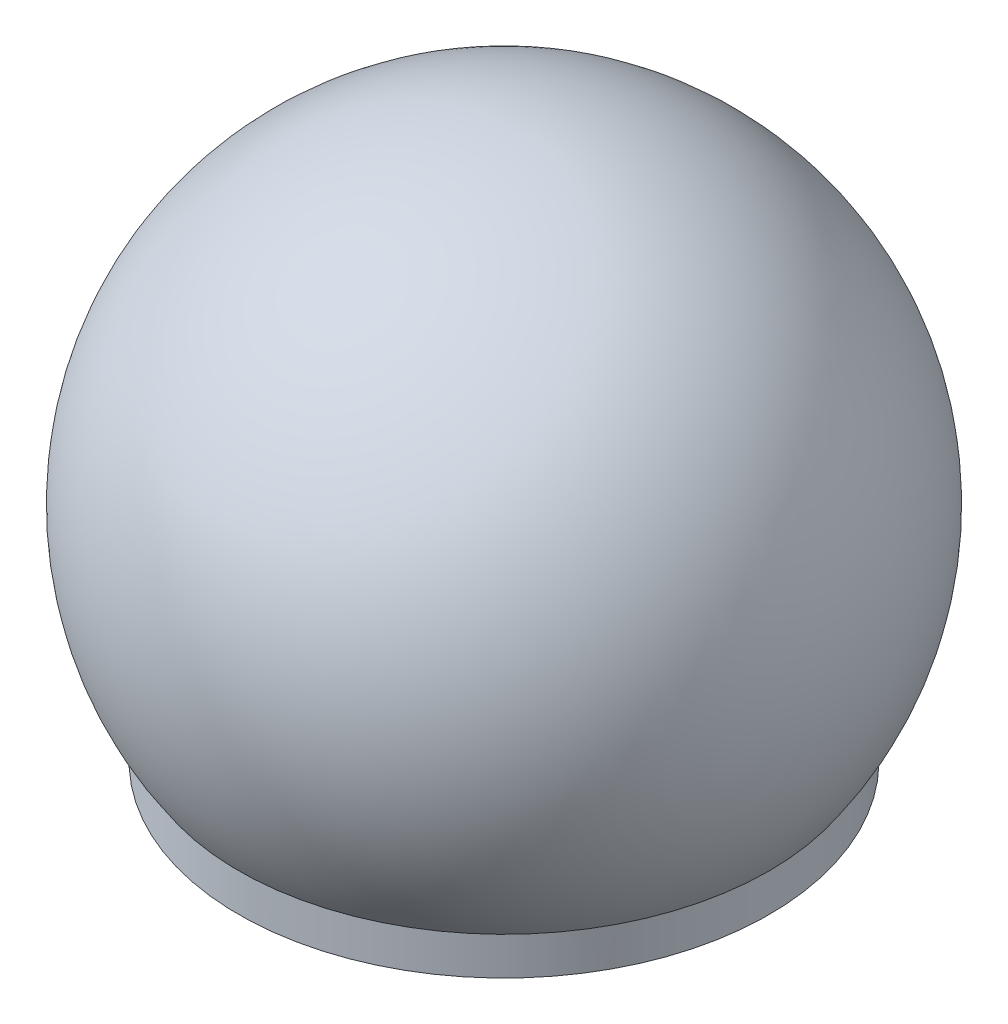
ISO-10303-21;
HEADER;
FILE_DESCRIPTION(('STEP AP214'),'2;1');
FILE_NAME('part.step','',(''),(''),'','','');
FILE_SCHEMA(('AUTOMOTIVE_DESIGN { 1 0 10303 214 1 1 1 1 }'));
ENDSEC;
DATA;
#1=APPLICATION_CONTEXT('core data for automotive mechanical design processes');
#2=APPLICATION_PROTOCOL_DEFINITION('international standard','automotive_design',2000,#1);
#3=PRODUCT_CONTEXT('',#1,'mechanical');
#4=PRODUCT('Part','Part','',(#3));
#5=PRODUCT_RELATED_PRODUCT_CATEGORY('part','',(#4));
#6=PRODUCT_DEFINITION_FORMATION('','',#4);
#7=PRODUCT_DEFINITION_CONTEXT('part definition',#1,'design');
#8=PRODUCT_DEFINITION('design','',#6,#7);
#9=PRODUCT_DEFINITION_SHAPE('','',#8);
#10=(LENGTH_UNIT() NAMED_UNIT(*) SI_UNIT(.MILLI.,.METRE.));
#11=(NAMED_UNIT(*) PLANE_ANGLE_UNIT() SI_UNIT($,.RADIAN.));
#12=(NAMED_UNIT(*) SI_UNIT($,.STERADIAN.) SOLID_ANGLE_UNIT());
#13=UNCERTAINTY_MEASURE_WITH_UNIT(LENGTH_MEASURE(1.E-05),#10,'distance_accuracy_value','');
#14=(GEOMETRIC_REPRESENTATION_CONTEXT(3) GLOBAL_UNCERTAINTY_ASSIGNED_CONTEXT((#13)) GLOBAL_UNIT_ASSIGNED_CONTEXT((#10,
#11,#12)) REPRESENTATION_CONTEXT('',''));
#15=CARTESIAN_POINT('',(0.,0.,0.));
#16=DIRECTION('',(0.,0.,1.));
#17=DIRECTION('',(1.,0.,0.));
#18=AXIS2_PLACEMENT_3D('',#15,#16,#17);
#19=CARTESIAN_POINT('',(0.,0.,0.));
#20=DIRECTION('',(0.,-1.,0.));
#21=DIRECTION('',(0.,0.,-1.));
#22=AXIS2_PLACEMENT_3D('',#19,#20,#21);
#23=CYLINDRICAL_SURFACE('',#22,22.225);
#24=CARTESIAN_POINT('',(0.,0.,0.));
#25=DIRECTION('',(0.,-1.,0.));
#26=DIRECTION('',(0.,0.,-1.));
#27=AXIS2_PLACEMENT_3D('',#24,#25,#26);
#28=CIRCLE('',#27,22.225);
#29=CARTESIAN_POINT('',(0.,0.,-22.225));
#30=VERTEX_POINT('',#29);
#31=EDGE_CURVE('E62',#30,#30,#28,.T.);
#32=ORIENTED_EDGE('',*,*,#31,.F.);
#33=EDGE_LOOP('',(#32));
#34=FACE_BOUND('',#33,.T.);
#35=CARTESIAN_POINT('',(0.,3.175,0.));
#36=DIRECTION('',(0.,-1.,0.));
#37=DIRECTION('',(0.,0.,-1.));
#38=AXIS2_PLACEMENT_3D('',#35,#36,#37);
#39=CIRCLE('',#38,22.225);
#40=CARTESIAN_POINT('',(0.,3.175,-22.225));
#41=VERTEX_POINT('',#40);
#42=EDGE_CURVE('E10',#41,#41,#39,.T.);
#43=ORIENTED_EDGE('',*,*,#42,.T.);
#44=EDGE_LOOP('',(#43));
#45=FACE_BOUND('',#44,.T.);
#46=ADVANCED_FACE('F28',(#34,#45),#23,.T.);
#47=CARTESIAN_POINT('',(0.,18.7371125367108,0.));
#48=DIRECTION('',(0.,-1.,0.));
#49=DIRECTION('',(1.,0.,0.));
#50=AXIS2_PLACEMENT_3D('',#47,#48,#49);
#51=SPHERICAL_SURFACE('',#50,27.1317152352234);
#52=ORIENTED_EDGE('',*,*,#42,.F.);
#53=EDGE_LOOP('',(#52));
#54=FACE_BOUND('',#53,.T.);
#55=ADVANCED_FACE('F69',(#54),#51,.T.);
#56=CARTESIAN_POINT('',(6.35,42.8136965511184,0.));
#57=DIRECTION('',(0.,1.,0.));
#58=DIRECTION('',(0.,0.,1.));
#59=AXIS2_PLACEMENT_3D('',#56,#57,#58);
#60=PLANE('',#59);
#61=CARTESIAN_POINT('',(0.,42.8136965511184,0.));
#62=DIRECTION('',(0.,-1.,0.));
#63=DIRECTION('',(0.,0.,-1.));
#64=AXIS2_PLACEMENT_3D('',#61,#62,#63);
#65=CIRCLE('',#64,6.35);
#66=CARTESIAN_POINT('',(0.,42.8136965511184,-6.35000000000001));
#67=VERTEX_POINT('',#66);
#68=EDGE_CURVE('E34',#67,#67,#65,.T.);
#69=ORIENTED_EDGE('',*,*,#68,.T.);
#70=EDGE_LOOP('',(#69));
#71=FACE_BOUND('',#70,.T.);
#72=ADVANCED_FACE('F73',(#71),#60,.F.);
#73=CARTESIAN_POINT('',(0.,15.6445954452988,0.));
#74=DIRECTION('',(0.,-1.,0.));
#75=DIRECTION('',(0.,0.,-1.));
#76=AXIS2_PLACEMENT_3D('',#73,#74,#75);
#77=CONICAL_SURFACE('',#76,25.3740094006764,0.610865238198008);
#78=CARTESIAN_POINT('',(0.,15.6445954452988,0.));
#79=DIRECTION('',(0.,-1.,0.));
#80=DIRECTION('',(0.,0.,-1.));
#81=AXIS2_PLACEMENT_3D('',#78,#79,#80);
#82=CIRCLE('',#81,25.3740094006764);
#83=CARTESIAN_POINT('',(0.,15.6445954452988,-25.3740094006764));
#84=VERTEX_POINT('',#83);
#85=EDGE_CURVE('E38',#84,#84,#82,.T.);
#86=CARTESIAN_POINT('',(0.,42.8136965511184,-6.35000000000001));
#87=CARTESIAN_POINT('',(0.,42.5306850812661,-6.54816676459039));
#88=CARTESIAN_POINT('',(0.,42.2476736114138,-6.74633352918077));
#89=CARTESIAN_POINT('',(0.,41.6816506717092,-7.14266705836153));
#90=CARTESIAN_POINT('',(0.,41.398639201857,-7.3408338229519));
#91=CARTESIAN_POINT('',(0.,40.8326162621524,-7.73716735213266));
#92=CARTESIAN_POINT('',(0.,40.5496047923001,-7.93533411672304));
#93=CARTESIAN_POINT('',(0.,39.9835818525955,-8.3316676459038));
#94=CARTESIAN_POINT('',(0.,39.7005703827432,-8.52983441049418));
#95=CARTESIAN_POINT('',(0.,39.1345474430387,-8.92616793967493));
#96=CARTESIAN_POINT('',(0.,38.8515359731864,-9.12433470426532));
#97=CARTESIAN_POINT('',(0.,38.2855130334818,-9.52066823344607));
#98=CARTESIAN_POINT('',(0.,38.0025015636295,-9.71883499803645));
#99=CARTESIAN_POINT('',(0.,37.4364786239249,-10.1151685272172));
#100=CARTESIAN_POINT('',(0.,37.1534671540726,-10.3133352918076));
#101=CARTESIAN_POINT('',(0.,36.5874442143681,-10.7096688209883));
#102=CARTESIAN_POINT('',(0.,36.3044327445158,-10.9078355855787));
#103=CARTESIAN_POINT('',(0.,35.7384098048112,-11.3041691147595));
#104=CARTESIAN_POINT('',(0.,35.4553983349589,-11.5023358793499));
#105=CARTESIAN_POINT('',(0.,34.8893753952543,-11.8986694085306));
#106=CARTESIAN_POINT('',(0.,34.6063639254021,-12.096836173121));
#107=CARTESIAN_POINT('',(0.,34.0403409856975,-12.4931697023018));
#108=CARTESIAN_POINT('',(0.,33.7573295158452,-12.6913364668921));
#109=CARTESIAN_POINT('',(0.,33.1913065761406,-13.0876699960729));
#110=CARTESIAN_POINT('',(0.,32.9082951062883,-13.2858367606633));
#111=CARTESIAN_POINT('',(0.,32.3422721665838,-13.682170289844));
#112=CARTESIAN_POINT('',(0.,32.0592606967315,-13.8803370544344));
#113=CARTESIAN_POINT('',(0.,31.4932377570269,-14.2766705836152));
#114=CARTESIAN_POINT('',(0.,31.2102262871746,-14.4748373482055));
#115=CARTESIAN_POINT('',(0.,30.64420334747,-14.8711708773863));
#116=CARTESIAN_POINT('',(0.,30.3611918776177,-15.0693376419767));
#117=CARTESIAN_POINT('',(0.,29.7951689379132,-15.4656711711574));
#118=CARTESIAN_POINT('',(0.,29.5121574680609,-15.6638379357478));
#119=CARTESIAN_POINT('',(0.,28.9461345283563,-16.0601714649286));
#120=CARTESIAN_POINT('',(0.,28.663123058504,-16.258338229519));
#121=CARTESIAN_POINT('',(0.,28.0971001187994,-16.6546717586997));
#122=CARTESIAN_POINT('',(0.,27.8140886489472,-16.8528385232901));
#123=CARTESIAN_POINT('',(0.,27.2480657092426,-17.2491720524708));
#124=CARTESIAN_POINT('',(0.,26.9650542393903,-17.4473388170612));
#125=CARTESIAN_POINT('',(0.,26.3990312996857,-17.843672346242));
#126=CARTESIAN_POINT('',(0.,26.1160198298334,-18.0418391108324));
#127=CARTESIAN_POINT('',(0.,25.5499968901288,-18.4381726400131));
#128=CARTESIAN_POINT('',(0.,25.2669854202766,-18.6363394046035));
#129=CARTESIAN_POINT('',(0.,24.700962480572,-19.0326729337843));
#130=CARTESIAN_POINT('',(0.,24.4179510107197,-19.2308396983746));
#131=CARTESIAN_POINT('',(0.,23.8519280710151,-19.6271732275554));
#132=CARTESIAN_POINT('',(0.,23.5689166011628,-19.8253399921458));
#133=CARTESIAN_POINT('',(0.,23.0028936614583,-20.2216735213265));
#134=CARTESIAN_POINT('',(0.,22.719882191606,-20.4198402859169));
#135=CARTESIAN_POINT('',(0.,22.1538592519014,-20.8161738150977));
#136=CARTESIAN_POINT('',(0.,21.8708477820491,-21.014340579688));
#137=CARTESIAN_POINT('',(0.,21.3048248423445,-21.4106741088688));
#138=CARTESIAN_POINT('',(0.,21.0218133724922,-21.6088408734592));
#139=CARTESIAN_POINT('',(0.,20.4557904327877,-22.0051744026399));
#140=CARTESIAN_POINT('',(0.,20.1727789629354,-22.2033411672303));
#141=CARTESIAN_POINT('',(0.,19.6067560232308,-22.5996746964111));
#142=CARTESIAN_POINT('',(0.,19.3237445533785,-22.7978414610015));
#143=CARTESIAN_POINT('',(0.,18.7577216136739,-23.1941749901822));
#144=CARTESIAN_POINT('',(0.,18.4747101438217,-23.3923417547726));
#145=CARTESIAN_POINT('',(0.,17.9086872041171,-23.7886752839533));
#146=CARTESIAN_POINT('',(0.,17.6256757342648,-23.9868420485437));
#147=CARTESIAN_POINT('',(0.,17.0596527945602,-24.3831755777245));
#148=CARTESIAN_POINT('',(0.,16.7766413247079,-24.5813423423149));
#149=CARTESIAN_POINT('',(0.,16.2106183850033,-24.9776758714956));
#150=CARTESIAN_POINT('',(0.,15.9276069151511,-25.175842636086));
#151=CARTESIAN_POINT('',(0.,15.6445954452988,-25.3740094006764));
#152=B_SPLINE_CURVE_WITH_KNOTS('',3,(#86,#87,#88,#89,#90,#91,#92,#93,#94,#95,#96,#97,#98,#99,
#100,#101,#102,#103,#104,#105,#106,#107,#108,#109,#110,#111,#112,#113,#114,#115,#116,#117,#118,
#119,#120,#121,#122,#123,#124,#125,#126,#127,#128,#129,#130,#131,#132,#133,#134,#135,#136,#137,
#138,#139,#140,#141,#142,#143,#144,#145,#146,#147,#148,#149,#150,#151),.UNSPECIFIED.,.F.,.F.,(4,
2,2,2,2,2,2,2,2,2,2,2,2,2,2,2,2,2,2,2,2,2,2,2,2,2,2,2,2,2,2,2,4),(0.,1.0364796321711,
2.0729592643422,3.1094388965133,4.1459185286844,5.1823981608555,6.2188777930266,7.2553574251977,
8.2918370573688,9.3283166895399,10.364796321711,11.4012759538821,12.4377555860532,
13.4742352182243,14.5107148503954,15.5471944825665,16.5836741147376,17.6201537469087,
18.6566333790798,19.6931130112509,20.729592643422,21.7660722755931,22.8025519077642,
23.8390315399353,24.8755111721064,25.9119908042775,26.9484704364486,27.9849500686197,
29.0214297007908,30.0579093329619,31.094388965133,32.1308685973041,33.1673482294752),.UNSPECIFIED.);
#153=EDGE_CURVE('BSEAM78',#67,#84,#152,.T.);
#154=ORIENTED_EDGE('',*,*,#68,.F.);
#155=ORIENTED_EDGE('',*,*,#85,.T.);
#156=ORIENTED_EDGE('',*,*,#153,.T.);
#157=ORIENTED_EDGE('',*,*,#153,.F.);
#158=EDGE_LOOP('',(#154,#156,#155,#157));
#159=FACE_BOUND('',#158,.T.);
#160=ADVANCED_FACE('F78',(#159),#77,.F.);
#161=CARTESIAN_POINT('',(0.,3.175,0.));
#162=DIRECTION('',(0.,1.,0.));
#163=DIRECTION('',(0.,0.,1.));
#164=AXIS2_PLACEMENT_3D('',#161,#162,#163);
#165=CONICAL_SURFACE('',#164,21.1836,0.324193691883272);
#166=ORIENTED_EDGE('',*,*,#85,.F.);
#167=EDGE_LOOP('',(#166));
#168=FACE_BOUND('',#167,.T.);
#169=CARTESIAN_POINT('',(0.,3.175,0.));
#170=DIRECTION('',(0.,-1.,0.));
#171=DIRECTION('',(0.,0.,-1.));
#172=AXIS2_PLACEMENT_3D('',#169,#170,#171);
#173=CIRCLE('',#172,21.1836);
#174=CARTESIAN_POINT('',(0.,3.175,-21.1836));
#175=VERTEX_POINT('',#174);
#176=EDGE_CURVE('E42',#175,#175,#173,.T.);
#177=ORIENTED_EDGE('',*,*,#176,.T.);
#178=EDGE_LOOP('',(#177));
#179=FACE_BOUND('',#178,.T.);
#180=ADVANCED_FACE('F83',(#168,#179),#165,.F.);
#181=CARTESIAN_POINT('',(0.,0.,0.));
#182=DIRECTION('',(0.,-1.,0.));
#183=DIRECTION('',(0.,0.,-1.));
#184=AXIS2_PLACEMENT_3D('',#181,#182,#183);
#185=CYLINDRICAL_SURFACE('',#184,21.1836);
#186=ORIENTED_EDGE('',*,*,#176,.F.);
#187=EDGE_LOOP('',(#186));
#188=FACE_BOUND('',#187,.T.);
#189=CARTESIAN_POINT('',(0.,2.1082,0.));
#190=DIRECTION('',(0.,-1.,0.));
#191=DIRECTION('',(0.,0.,-1.));
#192=AXIS2_PLACEMENT_3D('',#189,#190,#191);
#193=CIRCLE('',#192,21.1836);
#194=CARTESIAN_POINT('',(0.,2.1082,-21.1836));
#195=VERTEX_POINT('',#194);
#196=EDGE_CURVE('E47',#195,#195,#193,.T.);
#197=ORIENTED_EDGE('',*,*,#196,.T.);
#198=EDGE_LOOP('',(#197));
#199=FACE_BOUND('',#198,.T.);
#200=ADVANCED_FACE('F87',(#188,#199),#185,.F.);
#201=CARTESIAN_POINT('',(6.35,2.1082,0.));
#202=DIRECTION('',(0.,-1.,0.));
#203=DIRECTION('',(0.,0.,-1.));
#204=AXIS2_PLACEMENT_3D('',#201,#202,#203);
#205=PLANE('',#204);
#206=ORIENTED_EDGE('',*,*,#196,.F.);
#207=EDGE_LOOP('',(#206));
#208=FACE_BOUND('',#207,.T.);
#209=CARTESIAN_POINT('',(0.,2.1082,0.));
#210=DIRECTION('',(0.,-1.,0.));
#211=DIRECTION('',(0.,0.,-1.));
#212=AXIS2_PLACEMENT_3D('',#209,#210,#211);
#213=CIRCLE('',#212,6.35);
#214=CARTESIAN_POINT('',(0.,2.1082,-6.35));
#215=VERTEX_POINT('',#214);
#216=EDGE_CURVE('E50',#215,#215,#213,.T.);
#217=ORIENTED_EDGE('',*,*,#216,.T.);
#218=EDGE_LOOP('',(#217));
#219=FACE_BOUND('',#218,.T.);
#220=ADVANCED_FACE('F91',(#208,#219),#205,.F.);
#221=CARTESIAN_POINT('',(0.,0.,0.));
#222=DIRECTION('',(0.,-1.,0.));
#223=DIRECTION('',(0.,0.,-1.));
#224=AXIS2_PLACEMENT_3D('',#221,#222,#223);
#225=CYLINDRICAL_SURFACE('',#224,6.35);
#226=ORIENTED_EDGE('',*,*,#216,.F.);
#227=EDGE_LOOP('',(#226));
#228=FACE_BOUND('',#227,.T.);
#229=CARTESIAN_POINT('',(0.,6.35,0.));
#230=DIRECTION('',(0.,-1.,0.));
#231=DIRECTION('',(0.,0.,-1.));
#232=AXIS2_PLACEMENT_3D('',#229,#230,#231);
#233=CIRCLE('',#232,6.35);
#234=CARTESIAN_POINT('',(0.,6.35,-6.35));
#235=VERTEX_POINT('',#234);
#236=EDGE_CURVE('E53',#235,#235,#233,.T.);
#237=ORIENTED_EDGE('',*,*,#236,.T.);
#238=EDGE_LOOP('',(#237));
#239=FACE_BOUND('',#238,.T.);
#240=ADVANCED_FACE('F95',(#228,#239),#225,.T.);
#241=CARTESIAN_POINT('',(1.5875,6.35,0.));
#242=DIRECTION('',(0.,-1.,0.));
#243=DIRECTION('',(0.,0.,-1.));
#244=AXIS2_PLACEMENT_3D('',#241,#242,#243);
#245=PLANE('',#244);
#246=ORIENTED_EDGE('',*,*,#236,.F.);
#247=EDGE_LOOP('',(#246));
#248=FACE_BOUND('',#247,.T.);
#249=CARTESIAN_POINT('',(0.,6.35,0.));
#250=DIRECTION('',(0.,-1.,0.));
#251=DIRECTION('',(0.,0.,-1.));
#252=AXIS2_PLACEMENT_3D('',#249,#250,#251);
#253=CIRCLE('',#252,1.5875);
#254=CARTESIAN_POINT('',(0.,6.35,-1.5875));
#255=VERTEX_POINT('',#254);
#256=EDGE_CURVE('E56',#255,#255,#253,.T.);
#257=ORIENTED_EDGE('',*,*,#256,.T.);
#258=EDGE_LOOP('',(#257));
#259=FACE_BOUND('',#258,.T.);
#260=ADVANCED_FACE('F99',(#248,#259),#245,.F.);
#261=CARTESIAN_POINT('',(0.,0.,0.));
#262=DIRECTION('',(0.,-1.,0.));
#263=DIRECTION('',(0.,0.,-1.));
#264=AXIS2_PLACEMENT_3D('',#261,#262,#263);
#265=CYLINDRICAL_SURFACE('',#264,1.5875);
#266=ORIENTED_EDGE('',*,*,#256,.F.);
#267=EDGE_LOOP('',(#266));
#268=FACE_BOUND('',#267,.T.);
#269=CARTESIAN_POINT('',(0.,0.,0.));
#270=DIRECTION('',(0.,-1.,0.));
#271=DIRECTION('',(0.,0.,-1.));
#272=AXIS2_PLACEMENT_3D('',#269,#270,#271);
#273=CIRCLE('',#272,1.5875);
#274=CARTESIAN_POINT('',(0.,0.,-1.5875));
#275=VERTEX_POINT('',#274);
#276=EDGE_CURVE('E59',#275,#275,#273,.T.);
#277=ORIENTED_EDGE('',*,*,#276,.T.);
#278=EDGE_LOOP('',(#277));
#279=FACE_BOUND('',#278,.T.);
#280=ADVANCED_FACE('F103',(#268,#279),#265,.F.);
#281=CARTESIAN_POINT('',(1.5875,0.,0.));
#282=DIRECTION('',(0.,1.,0.));
#283=DIRECTION('',(0.,0.,1.));
#284=AXIS2_PLACEMENT_3D('',#281,#282,#283);
#285=PLANE('',#284);
#286=ORIENTED_EDGE('',*,*,#276,.F.);
#287=EDGE_LOOP('',(#286));
#288=FACE_BOUND('',#287,.T.);
#289=ORIENTED_EDGE('',*,*,#31,.T.);
#290=EDGE_LOOP('',(#289));
#291=FACE_BOUND('',#290,.T.);
#292=ADVANCED_FACE('F66',(#288,#291),#285,.F.);
#293=CLOSED_SHELL('',(#46,#55,#72,#160,#180,#200,#220,#240,#260,#280,#292));
#294=MANIFOLD_SOLID_BREP('B2',#293);
#295=ADVANCED_BREP_SHAPE_REPRESENTATION('',(#18,#294),#14);
#296=SHAPE_DEFINITION_REPRESENTATION(#9,#295);
ENDSEC;
END-ISO-10303-21;
